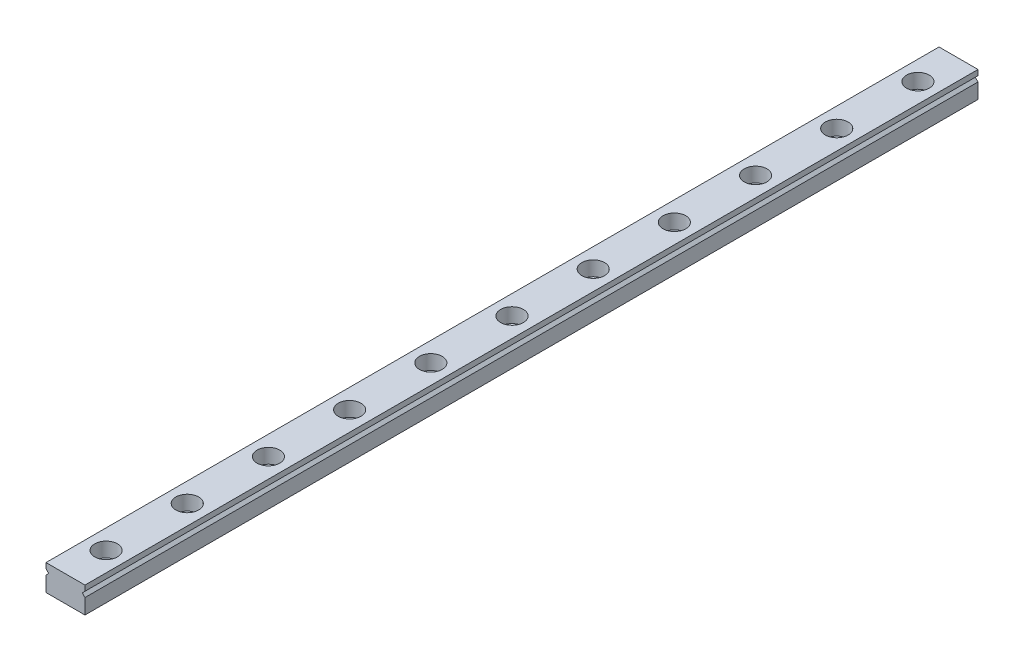
ISO-10303-21;
HEADER;
FILE_DESCRIPTION(('STEP AP214'),'2;1');
FILE_NAME('part.step','',(''),(''),'','','');
FILE_SCHEMA(('AUTOMOTIVE_DESIGN { 1 0 10303 214 1 1 1 1 }'));
ENDSEC;
DATA;
#1=APPLICATION_CONTEXT('core data for automotive mechanical design processes');
#2=APPLICATION_PROTOCOL_DEFINITION('international standard','automotive_design',2000,#1);
#3=PRODUCT_CONTEXT('',#1,'mechanical');
#4=PRODUCT('Part','Part','',(#3));
#5=PRODUCT_RELATED_PRODUCT_CATEGORY('part','',(#4));
#6=PRODUCT_DEFINITION_FORMATION('','',#4);
#7=PRODUCT_DEFINITION_CONTEXT('part definition',#1,'design');
#8=PRODUCT_DEFINITION('design','',#6,#7);
#9=PRODUCT_DEFINITION_SHAPE('','',#8);
#10=(LENGTH_UNIT() NAMED_UNIT(*) SI_UNIT(.MILLI.,.METRE.));
#11=(NAMED_UNIT(*) PLANE_ANGLE_UNIT() SI_UNIT($,.RADIAN.));
#12=(NAMED_UNIT(*) SI_UNIT($,.STERADIAN.) SOLID_ANGLE_UNIT());
#13=UNCERTAINTY_MEASURE_WITH_UNIT(LENGTH_MEASURE(1.E-05),#10,'distance_accuracy_value','');
#14=(GEOMETRIC_REPRESENTATION_CONTEXT(3) GLOBAL_UNCERTAINTY_ASSIGNED_CONTEXT((#13)) GLOBAL_UNIT_ASSIGNED_CONTEXT((#10,
#11,#12)) REPRESENTATION_CONTEXT('',''));
#15=CARTESIAN_POINT('',(0.,0.,0.));
#16=DIRECTION('',(0.,0.,1.));
#17=DIRECTION('',(1.,0.,0.));
#18=AXIS2_PLACEMENT_3D('',#15,#16,#17);
#19=CARTESIAN_POINT('',(1.27675647831893E-12,-3.,137.5));
#20=DIRECTION('',(0.,1.,0.));
#21=DIRECTION('',(0.,0.,1.));
#22=AXIS2_PLACEMENT_3D('',#19,#20,#21);
#23=CYLINDRICAL_SURFACE('',#22,2.5);
#24=CARTESIAN_POINT('',(1.27675647831893E-12,-3.,137.5));
#25=DIRECTION('',(0.,1.,0.));
#26=DIRECTION('',(0.,0.,1.));
#27=AXIS2_PLACEMENT_3D('',#24,#25,#26);
#28=CIRCLE('',#27,2.5);
#29=CARTESIAN_POINT('',(1.27675647831893E-12,-3.,140.));
#30=VERTEX_POINT('',#29);
#31=EDGE_CURVE('E323',#30,#30,#28,.T.);
#32=ORIENTED_EDGE('',*,*,#31,.F.);
#33=EDGE_LOOP('',(#32));
#34=FACE_BOUND('',#33,.T.);
#35=CARTESIAN_POINT('',(1.27675647831893E-12,0.5,137.5));
#36=DIRECTION('',(0.,1.,0.));
#37=DIRECTION('',(0.,0.,1.));
#38=AXIS2_PLACEMENT_3D('',#35,#36,#37);
#39=CIRCLE('',#38,2.5);
#40=CARTESIAN_POINT('',(1.27675647831893E-12,0.5,140.));
#41=VERTEX_POINT('',#40);
#42=EDGE_CURVE('E927',#41,#41,#39,.T.);
#43=ORIENTED_EDGE('',*,*,#42,.T.);
#44=EDGE_LOOP('',(#43));
#45=FACE_BOUND('',#44,.T.);
#46=ADVANCED_FACE('F40',(#34,#45),#23,.F.);
#47=CARTESIAN_POINT('',(2.66453525910038E-12,-3.,262.5));
#48=DIRECTION('',(0.,1.,0.));
#49=DIRECTION('',(0.,0.,1.));
#50=AXIS2_PLACEMENT_3D('',#47,#48,#49);
#51=CYLINDRICAL_SURFACE('',#50,2.5);
#52=CARTESIAN_POINT('',(2.66453525910038E-12,-3.,262.5));
#53=DIRECTION('',(0.,1.,0.));
#54=DIRECTION('',(0.,0.,1.));
#55=AXIS2_PLACEMENT_3D('',#52,#53,#54);
#56=CIRCLE('',#55,2.5);
#57=CARTESIAN_POINT('',(2.66453525910038E-12,-3.,265.));
#58=VERTEX_POINT('',#57);
#59=EDGE_CURVE('E279',#58,#58,#56,.T.);
#60=ORIENTED_EDGE('',*,*,#59,.F.);
#61=EDGE_LOOP('',(#60));
#62=FACE_BOUND('',#61,.T.);
#63=CARTESIAN_POINT('',(2.66453525910038E-12,0.499999999999987,262.5));
#64=DIRECTION('',(0.,1.,0.));
#65=DIRECTION('',(0.,0.,1.));
#66=AXIS2_PLACEMENT_3D('',#63,#64,#65);
#67=CIRCLE('',#66,2.5);
#68=CARTESIAN_POINT('',(2.66453525910038E-12,0.499999999999987,265.));
#69=VERTEX_POINT('',#68);
#70=EDGE_CURVE('E268',#69,#69,#67,.T.);
#71=ORIENTED_EDGE('',*,*,#70,.T.);
#72=EDGE_LOOP('',(#71));
#73=FACE_BOUND('',#72,.T.);
#74=ADVANCED_FACE('F346',(#62,#73),#51,.F.);
#75=CARTESIAN_POINT('',(2.27595720048157E-12,-3.,237.5));
#76=DIRECTION('',(0.,1.,0.));
#77=DIRECTION('',(0.,0.,1.));
#78=AXIS2_PLACEMENT_3D('',#75,#76,#77);
#79=CYLINDRICAL_SURFACE('',#78,2.5);
#80=CARTESIAN_POINT('',(2.27595720048157E-12,-3.,237.5));
#81=DIRECTION('',(0.,1.,0.));
#82=DIRECTION('',(0.,0.,1.));
#83=AXIS2_PLACEMENT_3D('',#80,#81,#82);
#84=CIRCLE('',#83,2.5);
#85=CARTESIAN_POINT('',(2.27595720048157E-12,-3.,240.));
#86=VERTEX_POINT('',#85);
#87=EDGE_CURVE('E277',#86,#86,#84,.T.);
#88=ORIENTED_EDGE('',*,*,#87,.F.);
#89=EDGE_LOOP('',(#88));
#90=FACE_BOUND('',#89,.T.);
#91=CARTESIAN_POINT('',(2.27595720048157E-12,0.5,237.5));
#92=DIRECTION('',(0.,1.,0.));
#93=DIRECTION('',(0.,0.,1.));
#94=AXIS2_PLACEMENT_3D('',#91,#92,#93);
#95=CIRCLE('',#94,2.5);
#96=CARTESIAN_POINT('',(2.27595720048157E-12,0.5,240.));
#97=VERTEX_POINT('',#96);
#98=EDGE_CURVE('E267',#97,#97,#95,.T.);
#99=ORIENTED_EDGE('',*,*,#98,.T.);
#100=EDGE_LOOP('',(#99));
#101=FACE_BOUND('',#100,.T.);
#102=ADVANCED_FACE('F352',(#90,#101),#79,.F.);
#103=CARTESIAN_POINT('',(2.05391259555654E-12,-3.,212.5));
#104=DIRECTION('',(0.,1.,0.));
#105=DIRECTION('',(0.,0.,1.));
#106=AXIS2_PLACEMENT_3D('',#103,#104,#105);
#107=CYLINDRICAL_SURFACE('',#106,2.5);
#108=CARTESIAN_POINT('',(2.05391259555654E-12,-3.,212.5));
#109=DIRECTION('',(0.,1.,0.));
#110=DIRECTION('',(0.,0.,1.));
#111=AXIS2_PLACEMENT_3D('',#108,#109,#110);
#112=CIRCLE('',#111,2.5);
#113=CARTESIAN_POINT('',(2.05391259555654E-12,-3.,215.));
#114=VERTEX_POINT('',#113);
#115=EDGE_CURVE('E274',#114,#114,#112,.T.);
#116=ORIENTED_EDGE('',*,*,#115,.F.);
#117=EDGE_LOOP('',(#116));
#118=FACE_BOUND('',#117,.T.);
#119=CARTESIAN_POINT('',(2.05391259555654E-12,0.5,212.5));
#120=DIRECTION('',(0.,1.,0.));
#121=DIRECTION('',(0.,0.,1.));
#122=AXIS2_PLACEMENT_3D('',#119,#120,#121);
#123=CIRCLE('',#122,2.5);
#124=CARTESIAN_POINT('',(2.05391259555654E-12,0.5,215.));
#125=VERTEX_POINT('',#124);
#126=EDGE_CURVE('E899',#125,#125,#123,.T.);
#127=ORIENTED_EDGE('',*,*,#126,.T.);
#128=EDGE_LOOP('',(#127));
#129=FACE_BOUND('',#128,.T.);
#130=ADVANCED_FACE('F364',(#118,#129),#107,.F.);
#131=CARTESIAN_POINT('',(1.88737914186277E-12,-3.,187.5));
#132=DIRECTION('',(0.,1.,0.));
#133=DIRECTION('',(0.,0.,1.));
#134=AXIS2_PLACEMENT_3D('',#131,#132,#133);
#135=CYLINDRICAL_SURFACE('',#134,2.5);
#136=CARTESIAN_POINT('',(1.88737914186277E-12,-3.,187.5));
#137=DIRECTION('',(0.,1.,0.));
#138=DIRECTION('',(0.,0.,1.));
#139=AXIS2_PLACEMENT_3D('',#136,#137,#138);
#140=CIRCLE('',#139,2.5);
#141=CARTESIAN_POINT('',(1.88737914186277E-12,-3.,190.));
#142=VERTEX_POINT('',#141);
#143=EDGE_CURVE('E282',#142,#142,#140,.T.);
#144=ORIENTED_EDGE('',*,*,#143,.F.);
#145=EDGE_LOOP('',(#144));
#146=FACE_BOUND('',#145,.T.);
#147=CARTESIAN_POINT('',(1.88737914186277E-12,0.5,187.5));
#148=DIRECTION('',(0.,1.,0.));
#149=DIRECTION('',(0.,0.,1.));
#150=AXIS2_PLACEMENT_3D('',#147,#148,#149);
#151=CIRCLE('',#150,2.5);
#152=CARTESIAN_POINT('',(1.88737914186277E-12,0.5,190.));
#153=VERTEX_POINT('',#152);
#154=EDGE_CURVE('E883',#153,#153,#151,.T.);
#155=ORIENTED_EDGE('',*,*,#154,.T.);
#156=EDGE_LOOP('',(#155));
#157=FACE_BOUND('',#156,.T.);
#158=ADVANCED_FACE('F361',(#146,#157),#135,.F.);
#159=CARTESIAN_POINT('',(1.49880108324396E-12,-3.,162.5));
#160=DIRECTION('',(0.,1.,0.));
#161=DIRECTION('',(0.,0.,1.));
#162=AXIS2_PLACEMENT_3D('',#159,#160,#161);
#163=CYLINDRICAL_SURFACE('',#162,2.5);
#164=CARTESIAN_POINT('',(1.49880108324396E-12,-3.,162.5));
#165=DIRECTION('',(0.,1.,0.));
#166=DIRECTION('',(0.,0.,1.));
#167=AXIS2_PLACEMENT_3D('',#164,#165,#166);
#168=CIRCLE('',#167,2.5);
#169=CARTESIAN_POINT('',(1.49880108324396E-12,-3.,165.));
#170=VERTEX_POINT('',#169);
#171=EDGE_CURVE('E180',#170,#170,#168,.T.);
#172=ORIENTED_EDGE('',*,*,#171,.F.);
#173=EDGE_LOOP('',(#172));
#174=FACE_BOUND('',#173,.T.);
#175=CARTESIAN_POINT('',(1.49880108324396E-12,0.5,162.5));
#176=DIRECTION('',(0.,1.,0.));
#177=DIRECTION('',(0.,0.,1.));
#178=AXIS2_PLACEMENT_3D('',#175,#176,#177);
#179=CIRCLE('',#178,2.5);
#180=CARTESIAN_POINT('',(1.49880108324396E-12,0.5,165.));
#181=VERTEX_POINT('',#180);
#182=EDGE_CURVE('E867',#181,#181,#179,.T.);
#183=ORIENTED_EDGE('',*,*,#182,.T.);
#184=EDGE_LOOP('',(#183));
#185=FACE_BOUND('',#184,.T.);
#186=ADVANCED_FACE('F363',(#174,#185),#163,.F.);
#187=CARTESIAN_POINT('',(1.0547118733939E-12,-3.,112.5));
#188=DIRECTION('',(0.,1.,0.));
#189=DIRECTION('',(0.,0.,1.));
#190=AXIS2_PLACEMENT_3D('',#187,#188,#189);
#191=CYLINDRICAL_SURFACE('',#190,2.5);
#192=CARTESIAN_POINT('',(1.0547118733939E-12,-3.,112.5));
#193=DIRECTION('',(0.,1.,0.));
#194=DIRECTION('',(0.,0.,1.));
#195=AXIS2_PLACEMENT_3D('',#192,#193,#194);
#196=CIRCLE('',#195,2.5);
#197=CARTESIAN_POINT('',(1.0547118733939E-12,-3.,115.));
#198=VERTEX_POINT('',#197);
#199=EDGE_CURVE('E302',#198,#198,#196,.T.);
#200=ORIENTED_EDGE('',*,*,#199,.F.);
#201=EDGE_LOOP('',(#200));
#202=FACE_BOUND('',#201,.T.);
#203=CARTESIAN_POINT('',(1.0547118733939E-12,0.5,112.5));
#204=DIRECTION('',(0.,1.,0.));
#205=DIRECTION('',(0.,0.,1.));
#206=AXIS2_PLACEMENT_3D('',#203,#204,#205);
#207=CIRCLE('',#206,2.5);
#208=CARTESIAN_POINT('',(1.0547118733939E-12,0.5,115.));
#209=VERTEX_POINT('',#208);
#210=EDGE_CURVE('E851',#209,#209,#207,.T.);
#211=ORIENTED_EDGE('',*,*,#210,.T.);
#212=EDGE_LOOP('',(#211));
#213=FACE_BOUND('',#212,.T.);
#214=ADVANCED_FACE('F375',(#202,#213),#191,.F.);
#215=CARTESIAN_POINT('',(7.21644966006352E-13,-3.00000000000001,87.5000000000001));
#216=DIRECTION('',(0.,1.,0.));
#217=DIRECTION('',(0.,0.,1.));
#218=AXIS2_PLACEMENT_3D('',#215,#216,#217);
#219=CYLINDRICAL_SURFACE('',#218,2.5);
#220=CARTESIAN_POINT('',(7.21644966006352E-13,-3.00000000000001,87.5000000000001));
#221=DIRECTION('',(0.,1.,0.));
#222=DIRECTION('',(0.,0.,1.));
#223=AXIS2_PLACEMENT_3D('',#220,#221,#222);
#224=CIRCLE('',#223,2.5);
#225=CARTESIAN_POINT('',(7.21644966006352E-13,-3.00000000000001,90.0000000000001));
#226=VERTEX_POINT('',#225);
#227=EDGE_CURVE('E308',#226,#226,#224,.T.);
#228=ORIENTED_EDGE('',*,*,#227,.F.);
#229=EDGE_LOOP('',(#228));
#230=FACE_BOUND('',#229,.T.);
#231=CARTESIAN_POINT('',(7.21644966006352E-13,0.499999999999994,87.5000000000001));
#232=DIRECTION('',(0.,1.,0.));
#233=DIRECTION('',(0.,0.,1.));
#234=AXIS2_PLACEMENT_3D('',#231,#232,#233);
#235=CIRCLE('',#234,2.5);
#236=CARTESIAN_POINT('',(7.21644966006352E-13,0.499999999999994,90.0000000000001));
#237=VERTEX_POINT('',#236);
#238=EDGE_CURVE('E835',#237,#237,#235,.T.);
#239=ORIENTED_EDGE('',*,*,#238,.T.);
#240=EDGE_LOOP('',(#239));
#241=FACE_BOUND('',#240,.T.);
#242=ADVANCED_FACE('F698',(#230,#241),#219,.F.);
#243=CARTESIAN_POINT('',(5.55111512312578E-13,-3.,62.5));
#244=DIRECTION('',(0.,1.,0.));
#245=DIRECTION('',(0.,0.,1.));
#246=AXIS2_PLACEMENT_3D('',#243,#244,#245);
#247=CYLINDRICAL_SURFACE('',#246,2.5);
#248=CARTESIAN_POINT('',(5.55111512312578E-13,-3.,62.5));
#249=DIRECTION('',(0.,1.,0.));
#250=DIRECTION('',(0.,0.,1.));
#251=AXIS2_PLACEMENT_3D('',#248,#249,#250);
#252=CIRCLE('',#251,2.5);
#253=CARTESIAN_POINT('',(5.55111512312578E-13,-3.,65.));
#254=VERTEX_POINT('',#253);
#255=EDGE_CURVE('E315',#254,#254,#252,.T.);
#256=ORIENTED_EDGE('',*,*,#255,.F.);
#257=EDGE_LOOP('',(#256));
#258=FACE_BOUND('',#257,.T.);
#259=CARTESIAN_POINT('',(5.55111512312578E-13,0.5,62.5));
#260=DIRECTION('',(0.,1.,0.));
#261=DIRECTION('',(0.,0.,1.));
#262=AXIS2_PLACEMENT_3D('',#259,#260,#261);
#263=CIRCLE('',#262,2.5);
#264=CARTESIAN_POINT('',(5.55111512312578E-13,0.5,65.));
#265=VERTEX_POINT('',#264);
#266=EDGE_CURVE('E819',#265,#265,#263,.T.);
#267=ORIENTED_EDGE('',*,*,#266,.T.);
#268=EDGE_LOOP('',(#267));
#269=FACE_BOUND('',#268,.T.);
#270=ADVANCED_FACE('F707',(#258,#269),#247,.F.);
#271=CARTESIAN_POINT('',(2.77555756156289E-13,-3.,37.5000000000001));
#272=DIRECTION('',(0.,1.,0.));
#273=DIRECTION('',(0.,0.,1.));
#274=AXIS2_PLACEMENT_3D('',#271,#272,#273);
#275=CYLINDRICAL_SURFACE('',#274,2.5);
#276=CARTESIAN_POINT('',(2.77555756156289E-13,-3.,37.5000000000001));
#277=DIRECTION('',(0.,1.,0.));
#278=DIRECTION('',(0.,0.,1.));
#279=AXIS2_PLACEMENT_3D('',#276,#277,#278);
#280=CIRCLE('',#279,2.5);
#281=CARTESIAN_POINT('',(2.77555756156289E-13,-3.,40.0000000000001));
#282=VERTEX_POINT('',#281);
#283=EDGE_CURVE('E319',#282,#282,#280,.T.);
#284=ORIENTED_EDGE('',*,*,#283,.F.);
#285=EDGE_LOOP('',(#284));
#286=FACE_BOUND('',#285,.T.);
#287=CARTESIAN_POINT('',(2.77555756156289E-13,0.5,37.5));
#288=DIRECTION('',(0.,1.,0.));
#289=DIRECTION('',(0.,0.,1.));
#290=AXIS2_PLACEMENT_3D('',#287,#288,#289);
#291=CIRCLE('',#290,2.5);
#292=CARTESIAN_POINT('',(2.77555756156289E-13,0.5,40.));
#293=VERTEX_POINT('',#292);
#294=EDGE_CURVE('E802',#293,#293,#291,.T.);
#295=ORIENTED_EDGE('',*,*,#294,.T.);
#296=EDGE_LOOP('',(#295));
#297=FACE_BOUND('',#296,.T.);
#298=ADVANCED_FACE('F359',(#286,#297),#275,.F.);
#299=CARTESIAN_POINT('',(0.,-3.,12.5));
#300=DIRECTION('',(0.,1.,0.));
#301=DIRECTION('',(0.,0.,1.));
#302=AXIS2_PLACEMENT_3D('',#299,#300,#301);
#303=CYLINDRICAL_SURFACE('',#302,2.5);
#304=CARTESIAN_POINT('',(0.,-3.,12.5));
#305=DIRECTION('',(0.,1.,0.));
#306=DIRECTION('',(0.,0.,1.));
#307=AXIS2_PLACEMENT_3D('',#304,#305,#306);
#308=CIRCLE('',#307,2.5);
#309=CARTESIAN_POINT('',(0.,-3.,15.));
#310=VERTEX_POINT('',#309);
#311=EDGE_CURVE('E299',#310,#310,#308,.T.);
#312=ORIENTED_EDGE('',*,*,#311,.F.);
#313=EDGE_LOOP('',(#312));
#314=FACE_BOUND('',#313,.T.);
#315=CARTESIAN_POINT('',(0.,0.5,12.5));
#316=DIRECTION('',(0.,1.,0.));
#317=DIRECTION('',(0.,0.,1.));
#318=AXIS2_PLACEMENT_3D('',#315,#316,#317);
#319=CIRCLE('',#318,2.5);
#320=CARTESIAN_POINT('',(0.,0.5,15.));
#321=VERTEX_POINT('',#320);
#322=EDGE_CURVE('E291',#321,#321,#319,.T.);
#323=ORIENTED_EDGE('',*,*,#322,.T.);
#324=EDGE_LOOP('',(#323));
#325=FACE_BOUND('',#324,.T.);
#326=ADVANCED_FACE('F344',(#314,#325),#303,.F.);
#327=CARTESIAN_POINT('',(-6.00000000000001,-3.00000000000001,275.));
#328=DIRECTION('',(0.,1.,0.));
#329=DIRECTION('',(0.,0.,1.));
#330=AXIS2_PLACEMENT_3D('',#327,#328,#329);
#331=PLANE('',#330);
#332=ORIENTED_EDGE('',*,*,#311,.T.);
#333=EDGE_LOOP('',(#332));
#334=FACE_BOUND('',#333,.T.);
#335=ORIENTED_EDGE('',*,*,#199,.T.);
#336=EDGE_LOOP('',(#335));
#337=FACE_BOUND('',#336,.T.);
#338=ORIENTED_EDGE('',*,*,#227,.T.);
#339=EDGE_LOOP('',(#338));
#340=FACE_BOUND('',#339,.T.);
#341=ORIENTED_EDGE('',*,*,#255,.T.);
#342=EDGE_LOOP('',(#341));
#343=FACE_BOUND('',#342,.T.);
#344=ORIENTED_EDGE('',*,*,#283,.T.);
#345=EDGE_LOOP('',(#344));
#346=FACE_BOUND('',#345,.T.);
#347=ORIENTED_EDGE('',*,*,#31,.T.);
#348=EDGE_LOOP('',(#347));
#349=FACE_BOUND('',#348,.T.);
#350=ORIENTED_EDGE('',*,*,#143,.T.);
#351=EDGE_LOOP('',(#350));
#352=FACE_BOUND('',#351,.T.);
#353=ORIENTED_EDGE('',*,*,#59,.T.);
#354=EDGE_LOOP('',(#353));
#355=FACE_BOUND('',#354,.T.);
#356=ORIENTED_EDGE('',*,*,#87,.T.);
#357=EDGE_LOOP('',(#356));
#358=FACE_BOUND('',#357,.T.);
#359=ORIENTED_EDGE('',*,*,#115,.T.);
#360=EDGE_LOOP('',(#359));
#361=FACE_BOUND('',#360,.T.);
#362=ORIENTED_EDGE('',*,*,#171,.T.);
#363=EDGE_LOOP('',(#362));
#364=FACE_BOUND('',#363,.T.);
#365=DIRECTION('',(1.,0.,0.));
#366=VECTOR('',#365,1.);
#367=CARTESIAN_POINT('',(-6.00000000000001,-3.,0.));
#368=LINE('',#367,#366);
#369=CARTESIAN_POINT('',(-6.00000000000001,-3.,0.));
#370=VERTEX_POINT('',#369);
#371=CARTESIAN_POINT('',(6.00000000000001,-3.,0.));
#372=VERTEX_POINT('',#371);
#373=EDGE_CURVE('E175',#370,#372,#368,.T.);
#374=ORIENTED_EDGE('',*,*,#373,.T.);
#375=DIRECTION('',(0.,0.,-1.));
#376=VECTOR('',#375,1.);
#377=CARTESIAN_POINT('',(6.00000000000001,-3.,275.));
#378=LINE('',#377,#376);
#379=CARTESIAN_POINT('',(6.00000000000001,-3.,275.));
#380=VERTEX_POINT('',#379);
#381=EDGE_CURVE('E11',#380,#372,#378,.T.);
#382=ORIENTED_EDGE('',*,*,#381,.F.);
#383=DIRECTION('',(1.,0.,0.));
#384=VECTOR('',#383,1.);
#385=CARTESIAN_POINT('',(-6.00000000000001,-3.00000000000001,275.));
#386=LINE('',#385,#384);
#387=CARTESIAN_POINT('',(-6.00000000000001,-3.00000000000001,275.));
#388=VERTEX_POINT('',#387);
#389=EDGE_CURVE('E204',#388,#380,#386,.T.);
#390=ORIENTED_EDGE('',*,*,#389,.F.);
#391=DIRECTION('',(0.,0.,-1.));
#392=VECTOR('',#391,1.);
#393=CARTESIAN_POINT('',(-6.00000000000001,-3.00000000000001,275.));
#394=LINE('',#393,#392);
#395=EDGE_CURVE('E171',#388,#370,#394,.T.);
#396=ORIENTED_EDGE('',*,*,#395,.T.);
#397=EDGE_LOOP('',(#374,#382,#390,#396));
#398=FACE_BOUND('',#397,.T.);
#399=ADVANCED_FACE('F42',(#334,#337,#340,#343,#346,#349,#352,#355,#358,#361,#364,#398),#331,.F.);
#400=CARTESIAN_POINT('',(6.00000000000001,-3.,275.));
#401=DIRECTION('',(-1.,0.,0.));
#402=DIRECTION('',(0.,0.,1.));
#403=AXIS2_PLACEMENT_3D('',#400,#401,#402);
#404=PLANE('',#403);
#405=DIRECTION('',(0.,1.,0.));
#406=VECTOR('',#405,1.);
#407=CARTESIAN_POINT('',(6.00000000000001,-3.,0.));
#408=LINE('',#407,#406);
#409=CARTESIAN_POINT('',(6.00000000000001,1.66666666666667,0.));
#410=VERTEX_POINT('',#409);
#411=EDGE_CURVE('E179',#372,#410,#408,.T.);
#412=ORIENTED_EDGE('',*,*,#411,.T.);
#413=DIRECTION('',(0.,0.,-1.));
#414=VECTOR('',#413,1.);
#415=CARTESIAN_POINT('',(6.00000000000001,1.66666666666667,275.));
#416=LINE('',#415,#414);
#417=CARTESIAN_POINT('',(6.00000000000001,1.66666666666667,275.));
#418=VERTEX_POINT('',#417);
#419=EDGE_CURVE('E50',#418,#410,#416,.T.);
#420=ORIENTED_EDGE('',*,*,#419,.F.);
#421=DIRECTION('',(0.,1.,0.));
#422=VECTOR('',#421,1.);
#423=CARTESIAN_POINT('',(6.00000000000001,-3.,275.));
#424=LINE('',#423,#422);
#425=EDGE_CURVE('E122',#380,#418,#424,.T.);
#426=ORIENTED_EDGE('',*,*,#425,.F.);
#427=ORIENTED_EDGE('',*,*,#381,.T.);
#428=EDGE_LOOP('',(#412,#420,#426,#427));
#429=FACE_BOUND('',#428,.T.);
#430=ADVANCED_FACE('F337',(#429),#404,.F.);
#431=CARTESIAN_POINT('',(6.00000000000001,1.66666666666667,275.));
#432=DIRECTION('',(-0.70710678118655,-0.707106781186545,0.));
#433=DIRECTION('',(0.707106781186545,-0.70710678118655,0.));
#434=AXIS2_PLACEMENT_3D('',#431,#432,#433);
#435=PLANE('',#434);
#436=DIRECTION('',(-0.707106781186545,0.70710678118655,0.));
#437=VECTOR('',#436,1.);
#438=CARTESIAN_POINT('',(6.00000000000001,1.66666666666667,0.));
#439=LINE('',#438,#437);
#440=CARTESIAN_POINT('',(5.16666666666665,2.5,0.));
#441=VERTEX_POINT('',#440);
#442=EDGE_CURVE('E183',#410,#441,#439,.T.);
#443=ORIENTED_EDGE('',*,*,#442,.T.);
#444=DIRECTION('',(0.,0.,-1.));
#445=VECTOR('',#444,1.);
#446=CARTESIAN_POINT('',(5.1666666666666,2.5,275.));
#447=LINE('',#446,#445);
#448=CARTESIAN_POINT('',(5.1666666666666,2.5,275.));
#449=VERTEX_POINT('',#448);
#450=EDGE_CURVE('E223',#449,#441,#447,.T.);
#451=ORIENTED_EDGE('',*,*,#450,.F.);
#452=DIRECTION('',(-0.707106781186545,0.70710678118655,0.));
#453=VECTOR('',#452,1.);
#454=CARTESIAN_POINT('',(6.00000000000001,1.66666666666667,275.));
#455=LINE('',#454,#453);
#456=EDGE_CURVE('E234',#418,#449,#455,.T.);
#457=ORIENTED_EDGE('',*,*,#456,.F.);
#458=ORIENTED_EDGE('',*,*,#419,.T.);
#459=EDGE_LOOP('',(#443,#451,#457,#458));
#460=FACE_BOUND('',#459,.T.);
#461=ADVANCED_FACE('F232',(#460),#435,.F.);
#462=CARTESIAN_POINT('',(5.1666666666666,2.5,275.));
#463=DIRECTION('',(-0.707106781186547,0.707106781186549,0.));
#464=DIRECTION('',(-0.707106781186548,-0.707106781186547,0.));
#465=AXIS2_PLACEMENT_3D('',#462,#463,#464);
#466=PLANE('',#465);
#467=DIRECTION('',(0.707106781186548,0.707106781186547,0.));
#468=VECTOR('',#467,1.);
#469=CARTESIAN_POINT('',(5.16666666666665,2.5,0.));
#470=LINE('',#469,#468);
#471=CARTESIAN_POINT('',(6.00000000000001,3.33333333333333,1.11022302462516E-13));
#472=VERTEX_POINT('',#471);
#473=EDGE_CURVE('E186',#441,#472,#470,.T.);
#474=ORIENTED_EDGE('',*,*,#473,.T.);
#475=DIRECTION('',(0.,0.,-1.));
#476=VECTOR('',#475,1.);
#477=CARTESIAN_POINT('',(6.00000000000001,3.33333333333333,275.));
#478=LINE('',#477,#476);
#479=CARTESIAN_POINT('',(6.00000000000001,3.33333333333333,275.));
#480=VERTEX_POINT('',#479);
#481=EDGE_CURVE('E219',#480,#472,#478,.T.);
#482=ORIENTED_EDGE('',*,*,#481,.F.);
#483=DIRECTION('',(0.707106781186548,0.707106781186547,0.));
#484=VECTOR('',#483,1.);
#485=CARTESIAN_POINT('',(5.1666666666666,2.5,275.));
#486=LINE('',#485,#484);
#487=EDGE_CURVE('E253',#449,#480,#486,.T.);
#488=ORIENTED_EDGE('',*,*,#487,.F.);
#489=ORIENTED_EDGE('',*,*,#450,.T.);
#490=EDGE_LOOP('',(#474,#482,#488,#489));
#491=FACE_BOUND('',#490,.T.);
#492=ADVANCED_FACE('F243',(#491),#466,.F.);
#493=CARTESIAN_POINT('',(6.00000000000001,3.33333333333333,275.));
#494=DIRECTION('',(-1.,0.,0.));
#495=DIRECTION('',(0.,0.,1.));
#496=AXIS2_PLACEMENT_3D('',#493,#494,#495);
#497=PLANE('',#496);
#498=DIRECTION('',(0.,1.,0.));
#499=VECTOR('',#498,1.);
#500=CARTESIAN_POINT('',(6.00000000000001,3.33333333333333,1.11022302462516E-13));
#501=LINE('',#500,#499);
#502=CARTESIAN_POINT('',(6.00000000000001,5.,1.11022302462516E-13));
#503=VERTEX_POINT('',#502);
#504=EDGE_CURVE('E189',#472,#503,#501,.T.);
#505=ORIENTED_EDGE('',*,*,#504,.T.);
#506=DIRECTION('',(0.,0.,-1.));
#507=VECTOR('',#506,1.);
#508=CARTESIAN_POINT('',(6.00000000000001,5.,275.));
#509=LINE('',#508,#507);
#510=CARTESIAN_POINT('',(6.00000000000001,5.,275.));
#511=VERTEX_POINT('',#510);
#512=EDGE_CURVE('E215',#511,#503,#509,.T.);
#513=ORIENTED_EDGE('',*,*,#512,.F.);
#514=DIRECTION('',(0.,1.,0.));
#515=VECTOR('',#514,1.);
#516=CARTESIAN_POINT('',(6.00000000000001,3.33333333333333,275.));
#517=LINE('',#516,#515);
#518=EDGE_CURVE('E249',#480,#511,#517,.T.);
#519=ORIENTED_EDGE('',*,*,#518,.F.);
#520=ORIENTED_EDGE('',*,*,#481,.T.);
#521=EDGE_LOOP('',(#505,#513,#519,#520));
#522=FACE_BOUND('',#521,.T.);
#523=ADVANCED_FACE('F247',(#522),#497,.F.);
#524=CARTESIAN_POINT('',(6.00000000000001,5.,275.));
#525=DIRECTION('',(0.,-1.,0.));
#526=DIRECTION('',(0.,0.,-1.));
#527=AXIS2_PLACEMENT_3D('',#524,#525,#526);
#528=PLANE('',#527);
#529=CARTESIAN_POINT('',(1.27675647831893E-12,5.,137.5));
#530=DIRECTION('',(0.,1.,0.));
#531=DIRECTION('',(0.,0.,1.));
#532=AXIS2_PLACEMENT_3D('',#529,#530,#531);
#533=CIRCLE('',#532,3.5);
#534=CARTESIAN_POINT('',(1.27675647831893E-12,5.,141.));
#535=VERTEX_POINT('',#534);
#536=EDGE_CURVE('E923',#535,#535,#533,.T.);
#537=ORIENTED_EDGE('',*,*,#536,.F.);
#538=EDGE_LOOP('',(#537));
#539=FACE_BOUND('',#538,.T.);
#540=CARTESIAN_POINT('',(2.66453525910038E-12,4.99999999999999,262.5));
#541=DIRECTION('',(0.,1.,0.));
#542=DIRECTION('',(0.,0.,1.));
#543=AXIS2_PLACEMENT_3D('',#540,#541,#542);
#544=CIRCLE('',#543,3.5);
#545=CARTESIAN_POINT('',(2.66453525910038E-12,4.99999999999999,266.));
#546=VERTEX_POINT('',#545);
#547=EDGE_CURVE('E915',#546,#546,#544,.T.);
#548=ORIENTED_EDGE('',*,*,#547,.F.);
#549=EDGE_LOOP('',(#548));
#550=FACE_BOUND('',#549,.T.);
#551=CARTESIAN_POINT('',(2.27595720048157E-12,5.,237.5));
#552=DIRECTION('',(0.,1.,0.));
#553=DIRECTION('',(0.,0.,1.));
#554=AXIS2_PLACEMENT_3D('',#551,#552,#553);
#555=CIRCLE('',#554,3.5);
#556=CARTESIAN_POINT('',(2.27595720048157E-12,5.,241.));
#557=VERTEX_POINT('',#556);
#558=EDGE_CURVE('E264',#557,#557,#555,.T.);
#559=ORIENTED_EDGE('',*,*,#558,.F.);
#560=EDGE_LOOP('',(#559));
#561=FACE_BOUND('',#560,.T.);
#562=CARTESIAN_POINT('',(2.05391259555654E-12,5.,212.5));
#563=DIRECTION('',(0.,1.,0.));
#564=DIRECTION('',(0.,0.,1.));
#565=AXIS2_PLACEMENT_3D('',#562,#563,#564);
#566=CIRCLE('',#565,3.5);
#567=CARTESIAN_POINT('',(2.05391259555654E-12,5.,216.));
#568=VERTEX_POINT('',#567);
#569=EDGE_CURVE('E905',#568,#568,#566,.T.);
#570=ORIENTED_EDGE('',*,*,#569,.F.);
#571=EDGE_LOOP('',(#570));
#572=FACE_BOUND('',#571,.T.);
#573=CARTESIAN_POINT('',(1.88737914186277E-12,5.,187.5));
#574=DIRECTION('',(0.,1.,0.));
#575=DIRECTION('',(0.,0.,1.));
#576=AXIS2_PLACEMENT_3D('',#573,#574,#575);
#577=CIRCLE('',#576,3.5);
#578=CARTESIAN_POINT('',(1.88737914186277E-12,5.,191.));
#579=VERTEX_POINT('',#578);
#580=EDGE_CURVE('E890',#579,#579,#577,.T.);
#581=ORIENTED_EDGE('',*,*,#580,.F.);
#582=EDGE_LOOP('',(#581));
#583=FACE_BOUND('',#582,.T.);
#584=CARTESIAN_POINT('',(1.49880108324396E-12,5.,162.5));
#585=DIRECTION('',(0.,1.,0.));
#586=DIRECTION('',(0.,0.,1.));
#587=AXIS2_PLACEMENT_3D('',#584,#585,#586);
#588=CIRCLE('',#587,3.5);
#589=CARTESIAN_POINT('',(1.49880108324396E-12,5.,166.));
#590=VERTEX_POINT('',#589);
#591=EDGE_CURVE('E874',#590,#590,#588,.T.);
#592=ORIENTED_EDGE('',*,*,#591,.F.);
#593=EDGE_LOOP('',(#592));
#594=FACE_BOUND('',#593,.T.);
#595=CARTESIAN_POINT('',(1.0547118733939E-12,5.,112.5));
#596=DIRECTION('',(0.,1.,0.));
#597=DIRECTION('',(0.,0.,1.));
#598=AXIS2_PLACEMENT_3D('',#595,#596,#597);
#599=CIRCLE('',#598,3.5);
#600=CARTESIAN_POINT('',(1.0547118733939E-12,5.,116.));
#601=VERTEX_POINT('',#600);
#602=EDGE_CURVE('E858',#601,#601,#599,.T.);
#603=ORIENTED_EDGE('',*,*,#602,.F.);
#604=EDGE_LOOP('',(#603));
#605=FACE_BOUND('',#604,.T.);
#606=CARTESIAN_POINT('',(7.21644966006352E-13,5.,87.5000000000001));
#607=DIRECTION('',(0.,1.,0.));
#608=DIRECTION('',(0.,0.,1.));
#609=AXIS2_PLACEMENT_3D('',#606,#607,#608);
#610=CIRCLE('',#609,3.5);
#611=CARTESIAN_POINT('',(7.21644966006352E-13,5.,91.0000000000001));
#612=VERTEX_POINT('',#611);
#613=EDGE_CURVE('E841',#612,#612,#610,.T.);
#614=ORIENTED_EDGE('',*,*,#613,.F.);
#615=EDGE_LOOP('',(#614));
#616=FACE_BOUND('',#615,.T.);
#617=CARTESIAN_POINT('',(5.55111512312578E-13,5.,62.5));
#618=DIRECTION('',(0.,1.,0.));
#619=DIRECTION('',(0.,0.,1.));
#620=AXIS2_PLACEMENT_3D('',#617,#618,#619);
#621=CIRCLE('',#620,3.5);
#622=CARTESIAN_POINT('',(5.55111512312578E-13,5.,66.));
#623=VERTEX_POINT('',#622);
#624=EDGE_CURVE('E825',#623,#623,#621,.T.);
#625=ORIENTED_EDGE('',*,*,#624,.F.);
#626=EDGE_LOOP('',(#625));
#627=FACE_BOUND('',#626,.T.);
#628=CARTESIAN_POINT('',(2.77555756156289E-13,5.,37.5));
#629=DIRECTION('',(0.,1.,0.));
#630=DIRECTION('',(0.,0.,1.));
#631=AXIS2_PLACEMENT_3D('',#628,#629,#630);
#632=CIRCLE('',#631,3.5);
#633=CARTESIAN_POINT('',(2.77555756156289E-13,5.,41.));
#634=VERTEX_POINT('',#633);
#635=EDGE_CURVE('E809',#634,#634,#632,.T.);
#636=ORIENTED_EDGE('',*,*,#635,.F.);
#637=EDGE_LOOP('',(#636));
#638=FACE_BOUND('',#637,.T.);
#639=CARTESIAN_POINT('',(0.,5.,12.5));
#640=DIRECTION('',(0.,1.,0.));
#641=DIRECTION('',(0.,0.,1.));
#642=AXIS2_PLACEMENT_3D('',#639,#640,#641);
#643=CIRCLE('',#642,3.5);
#644=CARTESIAN_POINT('',(0.,5.,16.));
#645=VERTEX_POINT('',#644);
#646=EDGE_CURVE('E295',#645,#645,#643,.T.);
#647=ORIENTED_EDGE('',*,*,#646,.F.);
#648=EDGE_LOOP('',(#647));
#649=FACE_BOUND('',#648,.T.);
#650=DIRECTION('',(-1.,0.,0.));
#651=VECTOR('',#650,1.);
#652=CARTESIAN_POINT('',(6.00000000000001,5.,1.11022302462516E-13));
#653=LINE('',#652,#651);
#654=CARTESIAN_POINT('',(-6.00000000000006,5.,1.11022302462516E-13));
#655=VERTEX_POINT('',#654);
#656=EDGE_CURVE('E192',#503,#655,#653,.T.);
#657=ORIENTED_EDGE('',*,*,#656,.T.);
#658=DIRECTION('',(0.,0.,-1.));
#659=VECTOR('',#658,1.);
#660=CARTESIAN_POINT('',(-6.00000000000001,5.,275.));
#661=LINE('',#660,#659);
#662=CARTESIAN_POINT('',(-6.00000000000001,5.,275.));
#663=VERTEX_POINT('',#662);
#664=EDGE_CURVE('E211',#663,#655,#661,.T.);
#665=ORIENTED_EDGE('',*,*,#664,.F.);
#666=DIRECTION('',(-1.,0.,0.));
#667=VECTOR('',#666,1.);
#668=CARTESIAN_POINT('',(6.00000000000001,5.,275.));
#669=LINE('',#668,#667);
#670=EDGE_CURVE('E252',#511,#663,#669,.T.);
#671=ORIENTED_EDGE('',*,*,#670,.F.);
#672=ORIENTED_EDGE('',*,*,#512,.T.);
#673=EDGE_LOOP('',(#657,#665,#671,#672));
#674=FACE_BOUND('',#673,.T.);
#675=ADVANCED_FACE('F392',(#539,#550,#561,#572,#583,#594,#605,#616,#627,#638,#649,#674),#528,.F.);
#676=CARTESIAN_POINT('',(-6.00000000000001,5.,275.));
#677=DIRECTION('',(1.,0.,0.));
#678=DIRECTION('',(0.,0.,-1.));
#679=AXIS2_PLACEMENT_3D('',#676,#677,#678);
#680=PLANE('',#679);
#681=DIRECTION('',(0.,-1.,0.));
#682=VECTOR('',#681,1.);
#683=CARTESIAN_POINT('',(-6.00000000000006,5.,1.11022302462516E-13));
#684=LINE('',#683,#682);
#685=CARTESIAN_POINT('',(-6.00000000000006,3.33333333333333,1.11022302462516E-13));
#686=VERTEX_POINT('',#685);
#687=EDGE_CURVE('E195',#655,#686,#684,.T.);
#688=ORIENTED_EDGE('',*,*,#687,.T.);
#689=DIRECTION('',(0.,0.,-1.));
#690=VECTOR('',#689,1.);
#691=CARTESIAN_POINT('',(-6.00000000000001,3.33333333333332,275.));
#692=LINE('',#691,#690);
#693=CARTESIAN_POINT('',(-6.00000000000001,3.33333333333332,275.));
#694=VERTEX_POINT('',#693);
#695=EDGE_CURVE('E163',#694,#686,#692,.T.);
#696=ORIENTED_EDGE('',*,*,#695,.F.);
#697=DIRECTION('',(0.,-1.,0.));
#698=VECTOR('',#697,1.);
#699=CARTESIAN_POINT('',(-6.00000000000001,5.,275.));
#700=LINE('',#699,#698);
#701=EDGE_CURVE('E152',#663,#694,#700,.T.);
#702=ORIENTED_EDGE('',*,*,#701,.F.);
#703=ORIENTED_EDGE('',*,*,#664,.T.);
#704=EDGE_LOOP('',(#688,#696,#702,#703));
#705=FACE_BOUND('',#704,.T.);
#706=ADVANCED_FACE('F389',(#705),#680,.F.);
#707=CARTESIAN_POINT('',(-6.00000000000001,3.33333333333332,275.));
#708=DIRECTION('',(0.707106781186545,0.70710678118655,0.));
#709=DIRECTION('',(-0.70710678118655,0.707106781186545,0.));
#710=AXIS2_PLACEMENT_3D('',#707,#708,#709);
#711=PLANE('',#710);
#712=DIRECTION('',(0.70710678118655,-0.707106781186545,0.));
#713=VECTOR('',#712,1.);
#714=CARTESIAN_POINT('',(-6.00000000000006,3.33333333333333,1.11022302462516E-13));
#715=LINE('',#714,#713);
#716=CARTESIAN_POINT('',(-5.16666666666671,2.50000000000001,1.11022302462516E-13));
#717=VERTEX_POINT('',#716);
#718=EDGE_CURVE('E161',#686,#717,#715,.T.);
#719=ORIENTED_EDGE('',*,*,#718,.T.);
#720=DIRECTION('',(0.,0.,-1.));
#721=VECTOR('',#720,1.);
#722=CARTESIAN_POINT('',(-5.16666666666665,2.5,275.));
#723=LINE('',#722,#721);
#724=CARTESIAN_POINT('',(-5.16666666666665,2.5,275.));
#725=VERTEX_POINT('',#724);
#726=EDGE_CURVE('E158',#725,#717,#723,.T.);
#727=ORIENTED_EDGE('',*,*,#726,.F.);
#728=DIRECTION('',(0.70710678118655,-0.707106781186545,0.));
#729=VECTOR('',#728,1.);
#730=CARTESIAN_POINT('',(-6.00000000000001,3.33333333333332,275.));
#731=LINE('',#730,#729);
#732=EDGE_CURVE('E146',#694,#725,#731,.T.);
#733=ORIENTED_EDGE('',*,*,#732,.F.);
#734=ORIENTED_EDGE('',*,*,#695,.T.);
#735=EDGE_LOOP('',(#719,#727,#733,#734));
#736=FACE_BOUND('',#735,.T.);
#737=ADVANCED_FACE('F159',(#736),#711,.F.);
#738=CARTESIAN_POINT('',(-5.16666666666665,2.5,275.));
#739=DIRECTION('',(0.70710678118655,-0.707106781186545,0.));
#740=DIRECTION('',(0.707106781186545,0.70710678118655,0.));
#741=AXIS2_PLACEMENT_3D('',#738,#739,#740);
#742=PLANE('',#741);
#743=DIRECTION('',(-0.707106781186545,-0.70710678118655,0.));
#744=VECTOR('',#743,1.);
#745=CARTESIAN_POINT('',(-5.16666666666671,2.50000000000001,1.11022302462516E-13));
#746=LINE('',#745,#744);
#747=CARTESIAN_POINT('',(-6.00000000000006,1.66666666666667,1.11022302462516E-13));
#748=VERTEX_POINT('',#747);
#749=EDGE_CURVE('E106',#717,#748,#746,.T.);
#750=ORIENTED_EDGE('',*,*,#749,.T.);
#751=DIRECTION('',(0.,0.,-1.));
#752=VECTOR('',#751,1.);
#753=CARTESIAN_POINT('',(-6.00000000000001,1.66666666666666,275.));
#754=LINE('',#753,#752);
#755=CARTESIAN_POINT('',(-6.00000000000001,1.66666666666666,275.));
#756=VERTEX_POINT('',#755);
#757=EDGE_CURVE('E164',#756,#748,#754,.T.);
#758=ORIENTED_EDGE('',*,*,#757,.F.);
#759=DIRECTION('',(-0.707106781186545,-0.70710678118655,0.));
#760=VECTOR('',#759,1.);
#761=CARTESIAN_POINT('',(-5.16666666666665,2.5,275.));
#762=LINE('',#761,#760);
#763=EDGE_CURVE('E150',#725,#756,#762,.T.);
#764=ORIENTED_EDGE('',*,*,#763,.F.);
#765=ORIENTED_EDGE('',*,*,#726,.T.);
#766=EDGE_LOOP('',(#750,#758,#764,#765));
#767=FACE_BOUND('',#766,.T.);
#768=ADVANCED_FACE('F166',(#767),#742,.F.);
#769=CARTESIAN_POINT('',(-6.00000000000001,1.66666666666666,275.));
#770=DIRECTION('',(1.,0.,0.));
#771=DIRECTION('',(0.,0.,-1.));
#772=AXIS2_PLACEMENT_3D('',#769,#770,#771);
#773=PLANE('',#772);
#774=DIRECTION('',(0.,-1.,0.));
#775=VECTOR('',#774,1.);
#776=CARTESIAN_POINT('',(-6.00000000000006,1.66666666666667,1.11022302462516E-13));
#777=LINE('',#776,#775);
#778=EDGE_CURVE('E112',#748,#370,#777,.T.);
#779=ORIENTED_EDGE('',*,*,#778,.T.);
#780=ORIENTED_EDGE('',*,*,#395,.F.);
#781=DIRECTION('',(0.,-1.,0.));
#782=VECTOR('',#781,1.);
#783=CARTESIAN_POINT('',(-6.00000000000001,1.66666666666666,275.));
#784=LINE('',#783,#782);
#785=EDGE_CURVE('E61',#756,#388,#784,.T.);
#786=ORIENTED_EDGE('',*,*,#785,.F.);
#787=ORIENTED_EDGE('',*,*,#757,.T.);
#788=EDGE_LOOP('',(#779,#780,#786,#787));
#789=FACE_BOUND('',#788,.T.);
#790=ADVANCED_FACE('F379',(#789),#773,.F.);
#791=CARTESIAN_POINT('',(0.,0.,275.));
#792=DIRECTION('',(0.,0.,1.));
#793=DIRECTION('',(1.,0.,0.));
#794=AXIS2_PLACEMENT_3D('',#791,#792,#793);
#795=PLANE('',#794);
#796=ORIENTED_EDGE('',*,*,#389,.T.);
#797=ORIENTED_EDGE('',*,*,#425,.T.);
#798=ORIENTED_EDGE('',*,*,#456,.T.);
#799=ORIENTED_EDGE('',*,*,#487,.T.);
#800=ORIENTED_EDGE('',*,*,#518,.T.);
#801=ORIENTED_EDGE('',*,*,#670,.T.);
#802=ORIENTED_EDGE('',*,*,#701,.T.);
#803=ORIENTED_EDGE('',*,*,#732,.T.);
#804=ORIENTED_EDGE('',*,*,#763,.T.);
#805=ORIENTED_EDGE('',*,*,#785,.T.);
#806=EDGE_LOOP('',(#796,#797,#798,#799,#800,#801,#802,#803,#804,#805));
#807=FACE_BOUND('',#806,.T.);
#808=ADVANCED_FACE('F148',(#807),#795,.T.);
#809=CARTESIAN_POINT('',(0.,0.,0.));
#810=DIRECTION('',(0.,0.,1.));
#811=DIRECTION('',(1.,0.,0.));
#812=AXIS2_PLACEMENT_3D('',#809,#810,#811);
#813=PLANE('',#812);
#814=ORIENTED_EDGE('',*,*,#373,.F.);
#815=ORIENTED_EDGE('',*,*,#778,.F.);
#816=ORIENTED_EDGE('',*,*,#749,.F.);
#817=ORIENTED_EDGE('',*,*,#718,.F.);
#818=ORIENTED_EDGE('',*,*,#687,.F.);
#819=ORIENTED_EDGE('',*,*,#656,.F.);
#820=ORIENTED_EDGE('',*,*,#504,.F.);
#821=ORIENTED_EDGE('',*,*,#473,.F.);
#822=ORIENTED_EDGE('',*,*,#442,.F.);
#823=ORIENTED_EDGE('',*,*,#411,.F.);
#824=EDGE_LOOP('',(#814,#815,#816,#817,#818,#819,#820,#821,#822,#823));
#825=FACE_BOUND('',#824,.T.);
#826=ADVANCED_FACE('F238',(#825),#813,.F.);
#827=CARTESIAN_POINT('',(0.,0.5,12.5));
#828=DIRECTION('',(0.,1.,0.));
#829=DIRECTION('',(0.,0.,1.));
#830=AXIS2_PLACEMENT_3D('',#827,#828,#829);
#831=CYLINDRICAL_SURFACE('',#830,3.5);
#832=CARTESIAN_POINT('',(0.,0.5,12.5));
#833=DIRECTION('',(0.,1.,0.));
#834=DIRECTION('',(0.,0.,1.));
#835=AXIS2_PLACEMENT_3D('',#832,#833,#834);
#836=CIRCLE('',#835,3.5);
#837=CARTESIAN_POINT('',(0.,0.5,16.));
#838=VERTEX_POINT('',#837);
#839=EDGE_CURVE('E294',#838,#838,#836,.T.);
#840=ORIENTED_EDGE('',*,*,#839,.F.);
#841=EDGE_LOOP('',(#840));
#842=FACE_BOUND('',#841,.T.);
#843=ORIENTED_EDGE('',*,*,#646,.T.);
#844=EDGE_LOOP('',(#843));
#845=FACE_BOUND('',#844,.T.);
#846=ADVANCED_FACE('F382',(#842,#845),#831,.F.);
#847=CARTESIAN_POINT('',(0.,0.5,0.));
#848=DIRECTION('',(0.,1.,0.));
#849=DIRECTION('',(0.,0.,1.));
#850=AXIS2_PLACEMENT_3D('',#847,#848,#849);
#851=PLANE('',#850);
#852=ORIENTED_EDGE('',*,*,#322,.F.);
#853=EDGE_LOOP('',(#852));
#854=FACE_BOUND('',#853,.T.);
#855=ORIENTED_EDGE('',*,*,#839,.T.);
#856=EDGE_LOOP('',(#855));
#857=FACE_BOUND('',#856,.T.);
#858=ADVANCED_FACE('F441',(#854,#857),#851,.T.);
#859=CARTESIAN_POINT('',(2.77555756156289E-13,0.5,37.5));
#860=DIRECTION('',(0.,1.,0.));
#861=DIRECTION('',(0.,0.,1.));
#862=AXIS2_PLACEMENT_3D('',#859,#860,#861);
#863=CYLINDRICAL_SURFACE('',#862,3.5);
#864=CARTESIAN_POINT('',(2.77555756156289E-13,0.5,37.5));
#865=DIRECTION('',(0.,1.,0.));
#866=DIRECTION('',(0.,0.,1.));
#867=AXIS2_PLACEMENT_3D('',#864,#865,#866);
#868=CIRCLE('',#867,3.5);
#869=CARTESIAN_POINT('',(2.77555756156289E-13,0.5,41.));
#870=VERTEX_POINT('',#869);
#871=EDGE_CURVE('E798',#870,#870,#868,.T.);
#872=ORIENTED_EDGE('',*,*,#871,.F.);
#873=EDGE_LOOP('',(#872));
#874=FACE_BOUND('',#873,.T.);
#875=ORIENTED_EDGE('',*,*,#635,.T.);
#876=EDGE_LOOP('',(#875));
#877=FACE_BOUND('',#876,.T.);
#878=ADVANCED_FACE('F449',(#874,#877),#863,.F.);
#879=CARTESIAN_POINT('',(0.,0.5,0.));
#880=DIRECTION('',(0.,1.,0.));
#881=DIRECTION('',(0.,0.,1.));
#882=AXIS2_PLACEMENT_3D('',#879,#880,#881);
#883=PLANE('',#882);
#884=ORIENTED_EDGE('',*,*,#294,.F.);
#885=EDGE_LOOP('',(#884));
#886=FACE_BOUND('',#885,.T.);
#887=ORIENTED_EDGE('',*,*,#871,.T.);
#888=EDGE_LOOP('',(#887));
#889=FACE_BOUND('',#888,.T.);
#890=ADVANCED_FACE('F457',(#886,#889),#883,.T.);
#891=CARTESIAN_POINT('',(5.55111512312578E-13,0.5,62.5));
#892=DIRECTION('',(0.,1.,0.));
#893=DIRECTION('',(0.,0.,1.));
#894=AXIS2_PLACEMENT_3D('',#891,#892,#893);
#895=CYLINDRICAL_SURFACE('',#894,3.5);
#896=CARTESIAN_POINT('',(5.55111512312578E-13,0.5,62.5));
#897=DIRECTION('',(0.,1.,0.));
#898=DIRECTION('',(0.,0.,1.));
#899=AXIS2_PLACEMENT_3D('',#896,#897,#898);
#900=CIRCLE('',#899,3.5);
#901=CARTESIAN_POINT('',(5.55111512312578E-13,0.5,66.));
#902=VERTEX_POINT('',#901);
#903=EDGE_CURVE('E814',#902,#902,#900,.T.);
#904=ORIENTED_EDGE('',*,*,#903,.F.);
#905=EDGE_LOOP('',(#904));
#906=FACE_BOUND('',#905,.T.);
#907=ORIENTED_EDGE('',*,*,#624,.T.);
#908=EDGE_LOOP('',(#907));
#909=FACE_BOUND('',#908,.T.);
#910=ADVANCED_FACE('F465',(#906,#909),#895,.F.);
#911=CARTESIAN_POINT('',(0.,0.5,0.));
#912=DIRECTION('',(0.,1.,0.));
#913=DIRECTION('',(0.,0.,1.));
#914=AXIS2_PLACEMENT_3D('',#911,#912,#913);
#915=PLANE('',#914);
#916=ORIENTED_EDGE('',*,*,#266,.F.);
#917=EDGE_LOOP('',(#916));
#918=FACE_BOUND('',#917,.T.);
#919=ORIENTED_EDGE('',*,*,#903,.T.);
#920=EDGE_LOOP('',(#919));
#921=FACE_BOUND('',#920,.T.);
#922=ADVANCED_FACE('F473',(#918,#921),#915,.T.);
#923=CARTESIAN_POINT('',(7.21644966006352E-13,0.499999999999994,87.5000000000001));
#924=DIRECTION('',(0.,1.,0.));
#925=DIRECTION('',(0.,0.,1.));
#926=AXIS2_PLACEMENT_3D('',#923,#924,#925);
#927=CYLINDRICAL_SURFACE('',#926,3.5);
#928=CARTESIAN_POINT('',(7.21644966006352E-13,0.499999999999994,87.5000000000001));
#929=DIRECTION('',(0.,1.,0.));
#930=DIRECTION('',(0.,0.,1.));
#931=AXIS2_PLACEMENT_3D('',#928,#929,#930);
#932=CIRCLE('',#931,3.5);
#933=CARTESIAN_POINT('',(7.21644966006352E-13,0.499999999999994,91.0000000000001));
#934=VERTEX_POINT('',#933);
#935=EDGE_CURVE('E829',#934,#934,#932,.T.);
#936=ORIENTED_EDGE('',*,*,#935,.F.);
#937=EDGE_LOOP('',(#936));
#938=FACE_BOUND('',#937,.T.);
#939=ORIENTED_EDGE('',*,*,#613,.T.);
#940=EDGE_LOOP('',(#939));
#941=FACE_BOUND('',#940,.T.);
#942=ADVANCED_FACE('F481',(#938,#941),#927,.F.);
#943=CARTESIAN_POINT('',(0.,0.5,0.));
#944=DIRECTION('',(0.,1.,0.));
#945=DIRECTION('',(0.,0.,1.));
#946=AXIS2_PLACEMENT_3D('',#943,#944,#945);
#947=PLANE('',#946);
#948=ORIENTED_EDGE('',*,*,#238,.F.);
#949=EDGE_LOOP('',(#948));
#950=FACE_BOUND('',#949,.T.);
#951=ORIENTED_EDGE('',*,*,#935,.T.);
#952=EDGE_LOOP('',(#951));
#953=FACE_BOUND('',#952,.T.);
#954=ADVANCED_FACE('F490',(#950,#953),#947,.T.);
#955=CARTESIAN_POINT('',(1.0547118733939E-12,0.5,112.5));
#956=DIRECTION('',(0.,1.,0.));
#957=DIRECTION('',(0.,0.,1.));
#958=AXIS2_PLACEMENT_3D('',#955,#956,#957);
#959=CYLINDRICAL_SURFACE('',#958,3.5);
#960=CARTESIAN_POINT('',(1.0547118733939E-12,0.5,112.5));
#961=DIRECTION('',(0.,1.,0.));
#962=DIRECTION('',(0.,0.,1.));
#963=AXIS2_PLACEMENT_3D('',#960,#961,#962);
#964=CIRCLE('',#963,3.5);
#965=CARTESIAN_POINT('',(1.0547118733939E-12,0.5,116.));
#966=VERTEX_POINT('',#965);
#967=EDGE_CURVE('E845',#966,#966,#964,.T.);
#968=ORIENTED_EDGE('',*,*,#967,.F.);
#969=EDGE_LOOP('',(#968));
#970=FACE_BOUND('',#969,.T.);
#971=ORIENTED_EDGE('',*,*,#602,.T.);
#972=EDGE_LOOP('',(#971));
#973=FACE_BOUND('',#972,.T.);
#974=ADVANCED_FACE('F497',(#970,#973),#959,.F.);
#975=CARTESIAN_POINT('',(0.,0.5,0.));
#976=DIRECTION('',(0.,1.,0.));
#977=DIRECTION('',(0.,0.,1.));
#978=AXIS2_PLACEMENT_3D('',#975,#976,#977);
#979=PLANE('',#978);
#980=ORIENTED_EDGE('',*,*,#210,.F.);
#981=EDGE_LOOP('',(#980));
#982=FACE_BOUND('',#981,.T.);
#983=ORIENTED_EDGE('',*,*,#967,.T.);
#984=EDGE_LOOP('',(#983));
#985=FACE_BOUND('',#984,.T.);
#986=ADVANCED_FACE('F505',(#982,#985),#979,.T.);
#987=CARTESIAN_POINT('',(1.49880108324396E-12,0.5,162.5));
#988=DIRECTION('',(0.,1.,0.));
#989=DIRECTION('',(0.,0.,1.));
#990=AXIS2_PLACEMENT_3D('',#987,#988,#989);
#991=CYLINDRICAL_SURFACE('',#990,3.5);
#992=CARTESIAN_POINT('',(1.49880108324396E-12,0.5,162.5));
#993=DIRECTION('',(0.,1.,0.));
#994=DIRECTION('',(0.,0.,1.));
#995=AXIS2_PLACEMENT_3D('',#992,#993,#994);
#996=CIRCLE('',#995,3.5);
#997=CARTESIAN_POINT('',(1.49880108324396E-12,0.5,166.));
#998=VERTEX_POINT('',#997);
#999=EDGE_CURVE('E862',#998,#998,#996,.T.);
#1000=ORIENTED_EDGE('',*,*,#999,.F.);
#1001=EDGE_LOOP('',(#1000));
#1002=FACE_BOUND('',#1001,.T.);
#1003=ORIENTED_EDGE('',*,*,#591,.T.);
#1004=EDGE_LOOP('',(#1003));
#1005=FACE_BOUND('',#1004,.T.);
#1006=ADVANCED_FACE('F511',(#1002,#1005),#991,.F.);
#1007=CARTESIAN_POINT('',(0.,0.5,0.));
#1008=DIRECTION('',(0.,1.,0.));
#1009=DIRECTION('',(0.,0.,1.));
#1010=AXIS2_PLACEMENT_3D('',#1007,#1008,#1009);
#1011=PLANE('',#1010);
#1012=ORIENTED_EDGE('',*,*,#182,.F.);
#1013=EDGE_LOOP('',(#1012));
#1014=FACE_BOUND('',#1013,.T.);
#1015=ORIENTED_EDGE('',*,*,#999,.T.);
#1016=EDGE_LOOP('',(#1015));
#1017=FACE_BOUND('',#1016,.T.);
#1018=ADVANCED_FACE('F519',(#1014,#1017),#1011,.T.);
#1019=CARTESIAN_POINT('',(1.88737914186277E-12,0.5,187.5));
#1020=DIRECTION('',(0.,1.,0.));
#1021=DIRECTION('',(0.,0.,1.));
#1022=AXIS2_PLACEMENT_3D('',#1019,#1020,#1021);
#1023=CYLINDRICAL_SURFACE('',#1022,3.5);
#1024=CARTESIAN_POINT('',(1.88737914186277E-12,0.5,187.5));
#1025=DIRECTION('',(0.,1.,0.));
#1026=DIRECTION('',(0.,0.,1.));
#1027=AXIS2_PLACEMENT_3D('',#1024,#1025,#1026);
#1028=CIRCLE('',#1027,3.5);
#1029=CARTESIAN_POINT('',(1.88737914186277E-12,0.5,191.));
#1030=VERTEX_POINT('',#1029);
#1031=EDGE_CURVE('E878',#1030,#1030,#1028,.T.);
#1032=ORIENTED_EDGE('',*,*,#1031,.F.);
#1033=EDGE_LOOP('',(#1032));
#1034=FACE_BOUND('',#1033,.T.);
#1035=ORIENTED_EDGE('',*,*,#580,.T.);
#1036=EDGE_LOOP('',(#1035));
#1037=FACE_BOUND('',#1036,.T.);
#1038=ADVANCED_FACE('F525',(#1034,#1037),#1023,.F.);
#1039=CARTESIAN_POINT('',(0.,0.5,0.));
#1040=DIRECTION('',(0.,1.,0.));
#1041=DIRECTION('',(0.,0.,1.));
#1042=AXIS2_PLACEMENT_3D('',#1039,#1040,#1041);
#1043=PLANE('',#1042);
#1044=ORIENTED_EDGE('',*,*,#154,.F.);
#1045=EDGE_LOOP('',(#1044));
#1046=FACE_BOUND('',#1045,.T.);
#1047=ORIENTED_EDGE('',*,*,#1031,.T.);
#1048=EDGE_LOOP('',(#1047));
#1049=FACE_BOUND('',#1048,.T.);
#1050=ADVANCED_FACE('F533',(#1046,#1049),#1043,.T.);
#1051=CARTESIAN_POINT('',(2.05391259555654E-12,0.5,212.5));
#1052=DIRECTION('',(0.,1.,0.));
#1053=DIRECTION('',(0.,0.,1.));
#1054=AXIS2_PLACEMENT_3D('',#1051,#1052,#1053);
#1055=CYLINDRICAL_SURFACE('',#1054,3.5);
#1056=CARTESIAN_POINT('',(2.05391259555654E-12,0.5,212.5));
#1057=DIRECTION('',(0.,1.,0.));
#1058=DIRECTION('',(0.,0.,1.));
#1059=AXIS2_PLACEMENT_3D('',#1056,#1057,#1058);
#1060=CIRCLE('',#1059,3.5);
#1061=CARTESIAN_POINT('',(2.05391259555654E-12,0.5,216.));
#1062=VERTEX_POINT('',#1061);
#1063=EDGE_CURVE('E894',#1062,#1062,#1060,.T.);
#1064=ORIENTED_EDGE('',*,*,#1063,.F.);
#1065=EDGE_LOOP('',(#1064));
#1066=FACE_BOUND('',#1065,.T.);
#1067=ORIENTED_EDGE('',*,*,#569,.T.);
#1068=EDGE_LOOP('',(#1067));
#1069=FACE_BOUND('',#1068,.T.);
#1070=ADVANCED_FACE('F541',(#1066,#1069),#1055,.F.);
#1071=CARTESIAN_POINT('',(0.,0.5,0.));
#1072=DIRECTION('',(0.,1.,0.));
#1073=DIRECTION('',(0.,0.,1.));
#1074=AXIS2_PLACEMENT_3D('',#1071,#1072,#1073);
#1075=PLANE('',#1074);
#1076=ORIENTED_EDGE('',*,*,#126,.F.);
#1077=EDGE_LOOP('',(#1076));
#1078=FACE_BOUND('',#1077,.T.);
#1079=ORIENTED_EDGE('',*,*,#1063,.T.);
#1080=EDGE_LOOP('',(#1079));
#1081=FACE_BOUND('',#1080,.T.);
#1082=ADVANCED_FACE('F549',(#1078,#1081),#1075,.T.);
#1083=CARTESIAN_POINT('',(2.27595720048157E-12,0.5,237.5));
#1084=DIRECTION('',(0.,1.,0.));
#1085=DIRECTION('',(0.,0.,1.));
#1086=AXIS2_PLACEMENT_3D('',#1083,#1084,#1085);
#1087=CYLINDRICAL_SURFACE('',#1086,3.5);
#1088=CARTESIAN_POINT('',(2.27595720048157E-12,0.5,237.5));
#1089=DIRECTION('',(0.,1.,0.));
#1090=DIRECTION('',(0.,0.,1.));
#1091=AXIS2_PLACEMENT_3D('',#1088,#1089,#1090);
#1092=CIRCLE('',#1091,3.5);
#1093=CARTESIAN_POINT('',(2.27595720048157E-12,0.5,241.));
#1094=VERTEX_POINT('',#1093);
#1095=EDGE_CURVE('E272',#1094,#1094,#1092,.T.);
#1096=ORIENTED_EDGE('',*,*,#1095,.F.);
#1097=EDGE_LOOP('',(#1096));
#1098=FACE_BOUND('',#1097,.T.);
#1099=ORIENTED_EDGE('',*,*,#558,.T.);
#1100=EDGE_LOOP('',(#1099));
#1101=FACE_BOUND('',#1100,.T.);
#1102=ADVANCED_FACE('F557',(#1098,#1101),#1087,.F.);
#1103=CARTESIAN_POINT('',(0.,0.5,0.));
#1104=DIRECTION('',(0.,1.,0.));
#1105=DIRECTION('',(0.,0.,1.));
#1106=AXIS2_PLACEMENT_3D('',#1103,#1104,#1105);
#1107=PLANE('',#1106);
#1108=ORIENTED_EDGE('',*,*,#98,.F.);
#1109=EDGE_LOOP('',(#1108));
#1110=FACE_BOUND('',#1109,.T.);
#1111=ORIENTED_EDGE('',*,*,#1095,.T.);
#1112=EDGE_LOOP('',(#1111));
#1113=FACE_BOUND('',#1112,.T.);
#1114=ADVANCED_FACE('F565',(#1110,#1113),#1107,.T.);
#1115=CARTESIAN_POINT('',(2.66453525910038E-12,0.499999999999987,262.5));
#1116=DIRECTION('',(0.,1.,0.));
#1117=DIRECTION('',(0.,0.,1.));
#1118=AXIS2_PLACEMENT_3D('',#1115,#1116,#1117);
#1119=CYLINDRICAL_SURFACE('',#1118,3.5);
#1120=CARTESIAN_POINT('',(2.66453525910038E-12,0.499999999999987,262.5));
#1121=DIRECTION('',(0.,1.,0.));
#1122=DIRECTION('',(0.,0.,1.));
#1123=AXIS2_PLACEMENT_3D('',#1120,#1121,#1122);
#1124=CIRCLE('',#1123,3.5);
#1125=CARTESIAN_POINT('',(2.66453525910038E-12,0.499999999999987,266.));
#1126=VERTEX_POINT('',#1125);
#1127=EDGE_CURVE('E286',#1126,#1126,#1124,.T.);
#1128=ORIENTED_EDGE('',*,*,#1127,.F.);
#1129=EDGE_LOOP('',(#1128));
#1130=FACE_BOUND('',#1129,.T.);
#1131=ORIENTED_EDGE('',*,*,#547,.T.);
#1132=EDGE_LOOP('',(#1131));
#1133=FACE_BOUND('',#1132,.T.);
#1134=ADVANCED_FACE('F573',(#1130,#1133),#1119,.F.);
#1135=CARTESIAN_POINT('',(0.,0.5,0.));
#1136=DIRECTION('',(0.,1.,0.));
#1137=DIRECTION('',(0.,0.,1.));
#1138=AXIS2_PLACEMENT_3D('',#1135,#1136,#1137);
#1139=PLANE('',#1138);
#1140=ORIENTED_EDGE('',*,*,#1127,.T.);
#1141=EDGE_LOOP('',(#1140));
#1142=FACE_BOUND('',#1141,.T.);
#1143=ORIENTED_EDGE('',*,*,#70,.F.);
#1144=EDGE_LOOP('',(#1143));
#1145=FACE_BOUND('',#1144,.T.);
#1146=ADVANCED_FACE('F581',(#1142,#1145),#1139,.T.);
#1147=CARTESIAN_POINT('',(1.27675647831893E-12,0.5,137.5));
#1148=DIRECTION('',(0.,1.,0.));
#1149=DIRECTION('',(0.,0.,1.));
#1150=AXIS2_PLACEMENT_3D('',#1147,#1148,#1149);
#1151=CYLINDRICAL_SURFACE('',#1150,3.5);
#1152=CARTESIAN_POINT('',(1.27675647831893E-12,0.5,137.5));
#1153=DIRECTION('',(0.,1.,0.));
#1154=DIRECTION('',(0.,0.,1.));
#1155=AXIS2_PLACEMENT_3D('',#1152,#1153,#1154);
#1156=CIRCLE('',#1155,3.5);
#1157=CARTESIAN_POINT('',(1.27675647831893E-12,0.5,141.));
#1158=VERTEX_POINT('',#1157);
#1159=EDGE_CURVE('E918',#1158,#1158,#1156,.T.);
#1160=ORIENTED_EDGE('',*,*,#1159,.F.);
#1161=EDGE_LOOP('',(#1160));
#1162=FACE_BOUND('',#1161,.T.);
#1163=ORIENTED_EDGE('',*,*,#536,.T.);
#1164=EDGE_LOOP('',(#1163));
#1165=FACE_BOUND('',#1164,.T.);
#1166=ADVANCED_FACE('F589',(#1162,#1165),#1151,.F.);
#1167=CARTESIAN_POINT('',(0.,0.5,0.));
#1168=DIRECTION('',(0.,1.,0.));
#1169=DIRECTION('',(0.,0.,1.));
#1170=AXIS2_PLACEMENT_3D('',#1167,#1168,#1169);
#1171=PLANE('',#1170);
#1172=ORIENTED_EDGE('',*,*,#42,.F.);
#1173=EDGE_LOOP('',(#1172));
#1174=FACE_BOUND('',#1173,.T.);
#1175=ORIENTED_EDGE('',*,*,#1159,.T.);
#1176=EDGE_LOOP('',(#1175));
#1177=FACE_BOUND('',#1176,.T.);
#1178=ADVANCED_FACE('F597',(#1174,#1177),#1171,.T.);
#1179=CLOSED_SHELL('',(#46,#74,#102,#130,#158,#186,#214,#242,#270,#298,#326,#399,#430,#461,#492,
#523,#675,#706,#737,#768,#790,#808,#826,#846,#858,#878,#890,#910,#922,#942,#954,#974,#986,#1006,
#1018,#1038,#1050,#1070,#1082,#1102,#1114,#1134,#1146,#1166,#1178));
#1180=MANIFOLD_SOLID_BREP('B2',#1179);
#1181=ADVANCED_BREP_SHAPE_REPRESENTATION('',(#18,#1180),#14);
#1182=SHAPE_DEFINITION_REPRESENTATION(#9,#1181);
ENDSEC;
END-ISO-10303-21;
